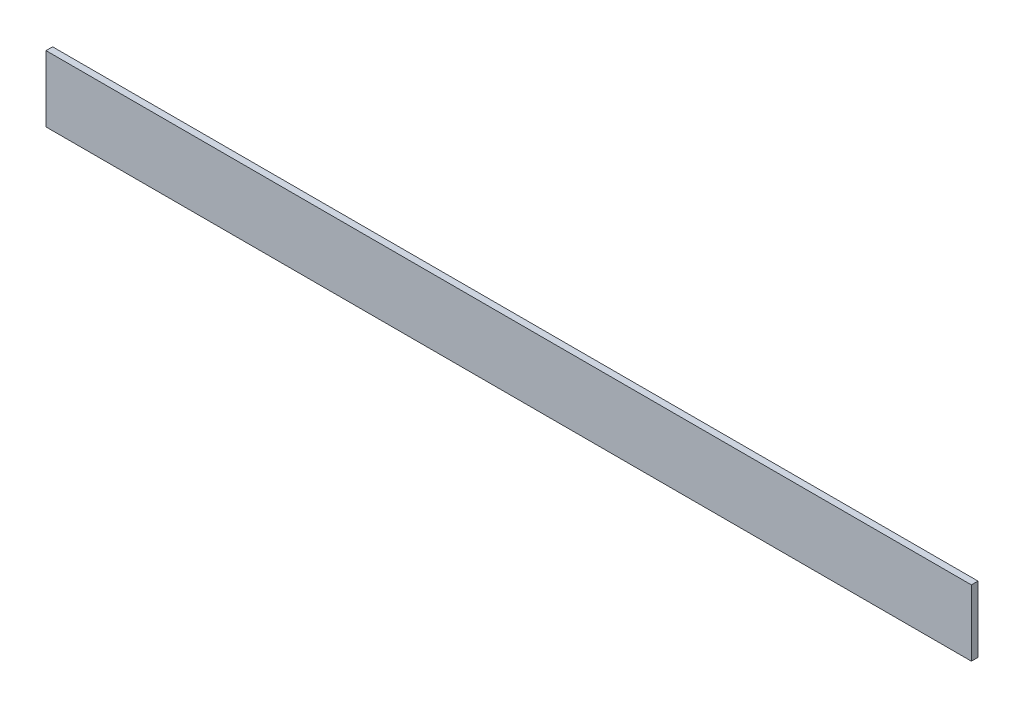
ISO-10303-21;
HEADER;
FILE_DESCRIPTION(('STEP AP214'),'2;1');
FILE_NAME('part.step','',(''),(''),'','','');
FILE_SCHEMA(('AUTOMOTIVE_DESIGN { 1 0 10303 214 1 1 1 1 }'));
ENDSEC;
DATA;
#1=APPLICATION_CONTEXT('core data for automotive mechanical design processes');
#2=APPLICATION_PROTOCOL_DEFINITION('international standard','automotive_design',2000,#1);
#3=PRODUCT_CONTEXT('',#1,'mechanical');
#4=PRODUCT('Part','Part','',(#3));
#5=PRODUCT_RELATED_PRODUCT_CATEGORY('part','',(#4));
#6=PRODUCT_DEFINITION_FORMATION('','',#4);
#7=PRODUCT_DEFINITION_CONTEXT('part definition',#1,'design');
#8=PRODUCT_DEFINITION('design','',#6,#7);
#9=PRODUCT_DEFINITION_SHAPE('','',#8);
#10=(LENGTH_UNIT() NAMED_UNIT(*) SI_UNIT(.MILLI.,.METRE.));
#11=(NAMED_UNIT(*) PLANE_ANGLE_UNIT() SI_UNIT($,.RADIAN.));
#12=(NAMED_UNIT(*) SI_UNIT($,.STERADIAN.) SOLID_ANGLE_UNIT());
#13=UNCERTAINTY_MEASURE_WITH_UNIT(LENGTH_MEASURE(1.E-05),#10,'distance_accuracy_value','');
#14=(GEOMETRIC_REPRESENTATION_CONTEXT(3) GLOBAL_UNCERTAINTY_ASSIGNED_CONTEXT((#13)) GLOBAL_UNIT_ASSIGNED_CONTEXT((#10,
#11,#12)) REPRESENTATION_CONTEXT('',''));
#15=CARTESIAN_POINT('',(0.,0.,0.));
#16=DIRECTION('',(0.,0.,1.));
#17=DIRECTION('',(1.,0.,0.));
#18=AXIS2_PLACEMENT_3D('',#15,#16,#17);
#19=CARTESIAN_POINT('',(0.,0.,-10.));
#20=DIRECTION('',(-1.,0.,0.));
#21=DIRECTION('',(0.,-1.,0.));
#22=AXIS2_PLACEMENT_3D('',#19,#20,#21);
#23=PLANE('',#22);
#24=DIRECTION('',(0.,-1.,0.));
#25=VECTOR('',#24,1.);
#26=CARTESIAN_POINT('',(0.,0.,0.));
#27=LINE('',#26,#25);
#28=CARTESIAN_POINT('',(0.,0.,0.));
#29=VERTEX_POINT('',#28);
#30=CARTESIAN_POINT('',(0.,-100.,0.));
#31=VERTEX_POINT('',#30);
#32=EDGE_CURVE('E106',#29,#31,#27,.T.);
#33=ORIENTED_EDGE('',*,*,#32,.F.);
#34=DIRECTION('',(0.,0.,1.));
#35=VECTOR('',#34,1.);
#36=CARTESIAN_POINT('',(0.,0.,-10.));
#37=LINE('',#36,#35);
#38=CARTESIAN_POINT('',(0.,0.,-10.));
#39=VERTEX_POINT('',#38);
#40=EDGE_CURVE('E11',#39,#29,#37,.T.);
#41=ORIENTED_EDGE('',*,*,#40,.F.);
#42=DIRECTION('',(0.,-1.,0.));
#43=VECTOR('',#42,1.);
#44=CARTESIAN_POINT('',(0.,0.,-10.));
#45=LINE('',#44,#43);
#46=CARTESIAN_POINT('',(0.,-100.,-10.));
#47=VERTEX_POINT('',#46);
#48=EDGE_CURVE('E100',#39,#47,#45,.T.);
#49=ORIENTED_EDGE('',*,*,#48,.T.);
#50=DIRECTION('',(0.,0.,1.));
#51=VECTOR('',#50,1.);
#52=CARTESIAN_POINT('',(0.,-100.,-10.));
#53=LINE('',#52,#51);
#54=EDGE_CURVE('E45',#47,#31,#53,.T.);
#55=ORIENTED_EDGE('',*,*,#54,.T.);
#56=EDGE_LOOP('',(#33,#41,#49,#55));
#57=FACE_BOUND('',#56,.T.);
#58=ADVANCED_FACE('F42',(#57),#23,.T.);
#59=CARTESIAN_POINT('',(0.,0.,-10.));
#60=DIRECTION('',(0.,1.,0.));
#61=DIRECTION('',(0.,0.,1.));
#62=AXIS2_PLACEMENT_3D('',#59,#60,#61);
#63=PLANE('',#62);
#64=DIRECTION('',(-1.,0.,0.));
#65=VECTOR('',#64,1.);
#66=CARTESIAN_POINT('',(0.,0.,0.));
#67=LINE('',#66,#65);
#68=CARTESIAN_POINT('',(1400.,0.,0.));
#69=VERTEX_POINT('',#68);
#70=EDGE_CURVE('E102',#69,#29,#67,.T.);
#71=ORIENTED_EDGE('',*,*,#70,.F.);
#72=DIRECTION('',(0.,0.,1.));
#73=VECTOR('',#72,1.);
#74=CARTESIAN_POINT('',(1400.,0.,-10.));
#75=LINE('',#74,#73);
#76=CARTESIAN_POINT('',(1400.,0.,-10.));
#77=VERTEX_POINT('',#76);
#78=EDGE_CURVE('E51',#77,#69,#75,.T.);
#79=ORIENTED_EDGE('',*,*,#78,.F.);
#80=DIRECTION('',(-1.,0.,0.));
#81=VECTOR('',#80,1.);
#82=CARTESIAN_POINT('',(0.,0.,-10.));
#83=LINE('',#82,#81);
#84=EDGE_CURVE('E97',#77,#39,#83,.T.);
#85=ORIENTED_EDGE('',*,*,#84,.T.);
#86=ORIENTED_EDGE('',*,*,#40,.T.);
#87=EDGE_LOOP('',(#71,#79,#85,#86));
#88=FACE_BOUND('',#87,.T.);
#89=ADVANCED_FACE('F116',(#88),#63,.T.);
#90=CARTESIAN_POINT('',(1400.,0.,-10.));
#91=DIRECTION('',(1.,0.,0.));
#92=DIRECTION('',(0.,0.,-1.));
#93=AXIS2_PLACEMENT_3D('',#90,#91,#92);
#94=PLANE('',#93);
#95=DIRECTION('',(0.,1.,0.));
#96=VECTOR('',#95,1.);
#97=CARTESIAN_POINT('',(1400.,0.,0.));
#98=LINE('',#97,#96);
#99=CARTESIAN_POINT('',(1400.,-100.,0.));
#100=VERTEX_POINT('',#99);
#101=EDGE_CURVE('E92',#100,#69,#98,.T.);
#102=ORIENTED_EDGE('',*,*,#101,.F.);
#103=DIRECTION('',(0.,0.,1.));
#104=VECTOR('',#103,1.);
#105=CARTESIAN_POINT('',(1400.,-100.,-10.));
#106=LINE('',#105,#104);
#107=CARTESIAN_POINT('',(1400.,-100.,-10.));
#108=VERTEX_POINT('',#107);
#109=EDGE_CURVE('E87',#108,#100,#106,.T.);
#110=ORIENTED_EDGE('',*,*,#109,.F.);
#111=DIRECTION('',(0.,1.,0.));
#112=VECTOR('',#111,1.);
#113=CARTESIAN_POINT('',(1400.,0.,-10.));
#114=LINE('',#113,#112);
#115=EDGE_CURVE('E90',#108,#77,#114,.T.);
#116=ORIENTED_EDGE('',*,*,#115,.T.);
#117=ORIENTED_EDGE('',*,*,#78,.T.);
#118=EDGE_LOOP('',(#102,#110,#116,#117));
#119=FACE_BOUND('',#118,.T.);
#120=ADVANCED_FACE('F89',(#119),#94,.T.);
#121=CARTESIAN_POINT('',(0.,-100.,-10.));
#122=DIRECTION('',(0.,-1.,0.));
#123=DIRECTION('',(0.,0.,-1.));
#124=AXIS2_PLACEMENT_3D('',#121,#122,#123);
#125=PLANE('',#124);
#126=DIRECTION('',(1.,0.,0.));
#127=VECTOR('',#126,1.);
#128=CARTESIAN_POINT('',(0.,-100.,0.));
#129=LINE('',#128,#127);
#130=EDGE_CURVE('E109',#31,#100,#129,.T.);
#131=ORIENTED_EDGE('',*,*,#130,.F.);
#132=ORIENTED_EDGE('',*,*,#54,.F.);
#133=DIRECTION('',(1.,0.,0.));
#134=VECTOR('',#133,1.);
#135=CARTESIAN_POINT('',(0.,-100.,-10.));
#136=LINE('',#135,#134);
#137=EDGE_CURVE('E96',#47,#108,#136,.T.);
#138=ORIENTED_EDGE('',*,*,#137,.T.);
#139=ORIENTED_EDGE('',*,*,#109,.T.);
#140=EDGE_LOOP('',(#131,#132,#138,#139));
#141=FACE_BOUND('',#140,.T.);
#142=ADVANCED_FACE('F99',(#141),#125,.T.);
#143=CARTESIAN_POINT('',(0.,0.,-10.));
#144=DIRECTION('',(0.,0.,1.));
#145=DIRECTION('',(1.,0.,0.));
#146=AXIS2_PLACEMENT_3D('',#143,#144,#145);
#147=PLANE('',#146);
#148=ORIENTED_EDGE('',*,*,#48,.F.);
#149=ORIENTED_EDGE('',*,*,#84,.F.);
#150=ORIENTED_EDGE('',*,*,#115,.F.);
#151=ORIENTED_EDGE('',*,*,#137,.F.);
#152=EDGE_LOOP('',(#148,#149,#150,#151));
#153=FACE_BOUND('',#152,.T.);
#154=ADVANCED_FACE('F95',(#153),#147,.F.);
#155=CARTESIAN_POINT('',(0.,0.,0.));
#156=DIRECTION('',(0.,0.,1.));
#157=DIRECTION('',(1.,0.,0.));
#158=AXIS2_PLACEMENT_3D('',#155,#156,#157);
#159=PLANE('',#158);
#160=ORIENTED_EDGE('',*,*,#32,.T.);
#161=ORIENTED_EDGE('',*,*,#130,.T.);
#162=ORIENTED_EDGE('',*,*,#101,.T.);
#163=ORIENTED_EDGE('',*,*,#70,.T.);
#164=EDGE_LOOP('',(#160,#161,#162,#163));
#165=FACE_BOUND('',#164,.T.);
#166=ADVANCED_FACE('F115',(#165),#159,.T.);
#167=CLOSED_SHELL('',(#58,#89,#120,#142,#154,#166));
#168=MANIFOLD_SOLID_BREP('B2',#167);
#169=ADVANCED_BREP_SHAPE_REPRESENTATION('',(#18,#168),#14);
#170=SHAPE_DEFINITION_REPRESENTATION(#9,#169);
ENDSEC;
END-ISO-10303-21;
